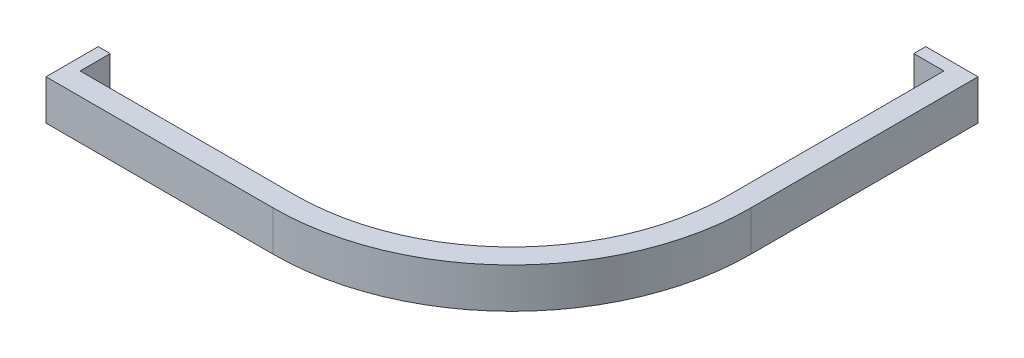
ISO-10303-21;
HEADER;
FILE_DESCRIPTION(('STEP AP214'),'2;1');
FILE_NAME('part.step','',(''),(''),'','','');
FILE_SCHEMA(('AUTOMOTIVE_DESIGN { 1 0 10303 214 1 1 1 1 }'));
ENDSEC;
DATA;
#1=APPLICATION_CONTEXT('core data for automotive mechanical design processes');
#2=APPLICATION_PROTOCOL_DEFINITION('international standard','automotive_design',2000,#1);
#3=PRODUCT_CONTEXT('',#1,'mechanical');
#4=PRODUCT('Part','Part','',(#3));
#5=PRODUCT_RELATED_PRODUCT_CATEGORY('part','',(#4));
#6=PRODUCT_DEFINITION_FORMATION('','',#4);
#7=PRODUCT_DEFINITION_CONTEXT('part definition',#1,'design');
#8=PRODUCT_DEFINITION('design','',#6,#7);
#9=PRODUCT_DEFINITION_SHAPE('','',#8);
#10=(LENGTH_UNIT() NAMED_UNIT(*) SI_UNIT(.MILLI.,.METRE.));
#11=(NAMED_UNIT(*) PLANE_ANGLE_UNIT() SI_UNIT($,.RADIAN.));
#12=(NAMED_UNIT(*) SI_UNIT($,.STERADIAN.) SOLID_ANGLE_UNIT());
#13=UNCERTAINTY_MEASURE_WITH_UNIT(LENGTH_MEASURE(1.E-05),#10,'distance_accuracy_value','');
#14=(GEOMETRIC_REPRESENTATION_CONTEXT(3) GLOBAL_UNCERTAINTY_ASSIGNED_CONTEXT((#13)) GLOBAL_UNIT_ASSIGNED_CONTEXT((#10,
#11,#12)) REPRESENTATION_CONTEXT('',''));
#15=CARTESIAN_POINT('',(0.,0.,0.));
#16=DIRECTION('',(0.,0.,1.));
#17=DIRECTION('',(1.,0.,0.));
#18=AXIS2_PLACEMENT_3D('',#15,#16,#17);
#19=CARTESIAN_POINT('',(0.,10.,103.07));
#20=DIRECTION('',(1.,0.,0.));
#21=DIRECTION('',(0.,0.,-1.));
#22=AXIS2_PLACEMENT_3D('',#19,#20,#21);
#23=PLANE('',#22);
#24=DIRECTION('',(0.,0.,1.));
#25=VECTOR('',#24,1.);
#26=CARTESIAN_POINT('',(0.,0.,103.07));
#27=LINE('',#26,#25);
#28=CARTESIAN_POINT('',(0.,0.,103.07));
#29=VERTEX_POINT('',#28);
#30=CARTESIAN_POINT('',(0.,0.,116.07));
#31=VERTEX_POINT('',#30);
#32=EDGE_CURVE('E153',#29,#31,#27,.T.);
#33=ORIENTED_EDGE('',*,*,#32,.T.);
#34=DIRECTION('',(0.,-1.,0.));
#35=VECTOR('',#34,1.);
#36=CARTESIAN_POINT('',(0.,10.,116.07));
#37=LINE('',#36,#35);
#38=CARTESIAN_POINT('',(0.,10.,116.07));
#39=VERTEX_POINT('',#38);
#40=EDGE_CURVE('E11',#39,#31,#37,.T.);
#41=ORIENTED_EDGE('',*,*,#40,.F.);
#42=DIRECTION('',(0.,0.,1.));
#43=VECTOR('',#42,1.);
#44=CARTESIAN_POINT('',(0.,10.,103.07));
#45=LINE('',#44,#43);
#46=CARTESIAN_POINT('',(0.,10.,103.07));
#47=VERTEX_POINT('',#46);
#48=EDGE_CURVE('E175',#47,#39,#45,.T.);
#49=ORIENTED_EDGE('',*,*,#48,.F.);
#50=DIRECTION('',(0.,-1.,0.));
#51=VECTOR('',#50,1.);
#52=CARTESIAN_POINT('',(0.,10.,103.07));
#53=LINE('',#52,#51);
#54=EDGE_CURVE('E149',#47,#29,#53,.T.);
#55=ORIENTED_EDGE('',*,*,#54,.T.);
#56=EDGE_LOOP('',(#33,#41,#49,#55));
#57=FACE_BOUND('',#56,.T.);
#58=ADVANCED_FACE('F33',(#57),#23,.F.);
#59=CARTESIAN_POINT('',(0.,10.,116.07));
#60=DIRECTION('',(0.,0.,-1.));
#61=DIRECTION('',(-1.,0.,0.));
#62=AXIS2_PLACEMENT_3D('',#59,#60,#61);
#63=PLANE('',#62);
#64=DIRECTION('',(1.,0.,0.));
#65=VECTOR('',#64,1.);
#66=CARTESIAN_POINT('',(0.,0.,116.07));
#67=LINE('',#66,#65);
#68=CARTESIAN_POINT('',(56.57,0.,116.07));
#69=VERTEX_POINT('',#68);
#70=EDGE_CURVE('E156',#31,#69,#67,.T.);
#71=ORIENTED_EDGE('',*,*,#70,.T.);
#72=DIRECTION('',(0.,-1.,0.));
#73=VECTOR('',#72,1.);
#74=CARTESIAN_POINT('',(56.57,10.,116.07));
#75=LINE('',#74,#73);
#76=CARTESIAN_POINT('',(56.57,10.,116.07));
#77=VERTEX_POINT('',#76);
#78=EDGE_CURVE('E41',#77,#69,#75,.T.);
#79=ORIENTED_EDGE('',*,*,#78,.F.);
#80=DIRECTION('',(1.,0.,0.));
#81=VECTOR('',#80,1.);
#82=CARTESIAN_POINT('',(0.,10.,116.07));
#83=LINE('',#82,#81);
#84=EDGE_CURVE('E104',#39,#77,#83,.T.);
#85=ORIENTED_EDGE('',*,*,#84,.F.);
#86=ORIENTED_EDGE('',*,*,#40,.T.);
#87=EDGE_LOOP('',(#71,#79,#85,#86));
#88=FACE_BOUND('',#87,.T.);
#89=ADVANCED_FACE('F253',(#88),#63,.F.);
#90=CARTESIAN_POINT('',(56.57,10.,56.57));
#91=DIRECTION('',(0.,-1.,0.));
#92=DIRECTION('',(0.,0.,-1.));
#93=AXIS2_PLACEMENT_3D('',#90,#91,#92);
#94=CYLINDRICAL_SURFACE('',#93,59.5);
#95=CARTESIAN_POINT('',(56.57,0.,56.57));
#96=DIRECTION('',(0.,1.,0.));
#97=DIRECTION('',(0.,0.,1.));
#98=AXIS2_PLACEMENT_3D('',#95,#96,#97);
#99=CIRCLE('',#98,59.5);
#100=CARTESIAN_POINT('',(116.07,0.,56.57));
#101=VERTEX_POINT('',#100);
#102=EDGE_CURVE('E158',#69,#101,#99,.T.);
#103=ORIENTED_EDGE('',*,*,#102,.T.);
#104=DIRECTION('',(0.,-1.,0.));
#105=VECTOR('',#104,1.);
#106=CARTESIAN_POINT('',(116.07,10.,56.57));
#107=LINE('',#106,#105);
#108=CARTESIAN_POINT('',(116.07,10.,56.57));
#109=VERTEX_POINT('',#108);
#110=EDGE_CURVE('E194',#109,#101,#107,.T.);
#111=ORIENTED_EDGE('',*,*,#110,.F.);
#112=CARTESIAN_POINT('',(56.57,10.,56.57));
#113=DIRECTION('',(0.,1.,0.));
#114=DIRECTION('',(0.,0.,1.));
#115=AXIS2_PLACEMENT_3D('',#112,#113,#114);
#116=CIRCLE('',#115,59.5);
#117=EDGE_CURVE('E202',#77,#109,#116,.T.);
#118=ORIENTED_EDGE('',*,*,#117,.F.);
#119=ORIENTED_EDGE('',*,*,#78,.T.);
#120=EDGE_LOOP('',(#103,#111,#118,#119));
#121=FACE_BOUND('',#120,.T.);
#122=ADVANCED_FACE('F200',(#121),#94,.T.);
#123=CARTESIAN_POINT('',(116.07,10.,56.57));
#124=DIRECTION('',(-1.,0.,0.));
#125=DIRECTION('',(0.,0.,1.));
#126=AXIS2_PLACEMENT_3D('',#123,#124,#125);
#127=PLANE('',#126);
#128=DIRECTION('',(0.,0.,-1.));
#129=VECTOR('',#128,1.);
#130=CARTESIAN_POINT('',(116.07,0.,56.57));
#131=LINE('',#130,#129);
#132=CARTESIAN_POINT('',(116.07,0.,0.));
#133=VERTEX_POINT('',#132);
#134=EDGE_CURVE('E160',#101,#133,#131,.T.);
#135=ORIENTED_EDGE('',*,*,#134,.T.);
#136=DIRECTION('',(0.,-1.,0.));
#137=VECTOR('',#136,1.);
#138=CARTESIAN_POINT('',(116.07,10.,0.));
#139=LINE('',#138,#137);
#140=CARTESIAN_POINT('',(116.07,10.,0.));
#141=VERTEX_POINT('',#140);
#142=EDGE_CURVE('E191',#141,#133,#139,.T.);
#143=ORIENTED_EDGE('',*,*,#142,.F.);
#144=DIRECTION('',(0.,0.,-1.));
#145=VECTOR('',#144,1.);
#146=CARTESIAN_POINT('',(116.07,10.,56.57));
#147=LINE('',#146,#145);
#148=EDGE_CURVE('E220',#109,#141,#147,.T.);
#149=ORIENTED_EDGE('',*,*,#148,.F.);
#150=ORIENTED_EDGE('',*,*,#110,.T.);
#151=EDGE_LOOP('',(#135,#143,#149,#150));
#152=FACE_BOUND('',#151,.T.);
#153=ADVANCED_FACE('F211',(#152),#127,.F.);
#154=CARTESIAN_POINT('',(116.07,10.,0.));
#155=DIRECTION('',(0.,0.,1.));
#156=DIRECTION('',(1.,0.,0.));
#157=AXIS2_PLACEMENT_3D('',#154,#155,#156);
#158=PLANE('',#157);
#159=DIRECTION('',(-1.,0.,0.));
#160=VECTOR('',#159,1.);
#161=CARTESIAN_POINT('',(116.07,0.,0.));
#162=LINE('',#161,#160);
#163=CARTESIAN_POINT('',(103.07,0.,0.));
#164=VERTEX_POINT('',#163);
#165=EDGE_CURVE('E162',#133,#164,#162,.T.);
#166=ORIENTED_EDGE('',*,*,#165,.T.);
#167=DIRECTION('',(0.,-1.,0.));
#168=VECTOR('',#167,1.);
#169=CARTESIAN_POINT('',(103.07,10.,0.));
#170=LINE('',#169,#168);
#171=CARTESIAN_POINT('',(103.07,10.,0.));
#172=VERTEX_POINT('',#171);
#173=EDGE_CURVE('E188',#172,#164,#170,.T.);
#174=ORIENTED_EDGE('',*,*,#173,.F.);
#175=DIRECTION('',(-1.,0.,0.));
#176=VECTOR('',#175,1.);
#177=CARTESIAN_POINT('',(116.07,10.,0.));
#178=LINE('',#177,#176);
#179=EDGE_CURVE('E217',#141,#172,#178,.T.);
#180=ORIENTED_EDGE('',*,*,#179,.F.);
#181=ORIENTED_EDGE('',*,*,#142,.T.);
#182=EDGE_LOOP('',(#166,#174,#180,#181));
#183=FACE_BOUND('',#182,.T.);
#184=ADVANCED_FACE('F215',(#183),#158,.F.);
#185=CARTESIAN_POINT('',(103.07,10.,2.99999999999999));
#186=DIRECTION('',(1.,0.,0.));
#187=DIRECTION('',(0.,0.,-1.));
#188=AXIS2_PLACEMENT_3D('',#185,#186,#187);
#189=PLANE('',#188);
#190=DIRECTION('',(0.,0.,1.));
#191=VECTOR('',#190,1.);
#192=CARTESIAN_POINT('',(103.07,0.,2.99999999999999));
#193=LINE('',#192,#191);
#194=CARTESIAN_POINT('',(103.07,0.,2.99999999999999));
#195=VERTEX_POINT('',#194);
#196=EDGE_CURVE('E164',#164,#195,#193,.T.);
#197=ORIENTED_EDGE('',*,*,#196,.T.);
#198=DIRECTION('',(0.,-1.,0.));
#199=VECTOR('',#198,1.);
#200=CARTESIAN_POINT('',(103.07,10.,2.99999999999999));
#201=LINE('',#200,#199);
#202=CARTESIAN_POINT('',(103.07,10.,2.99999999999999));
#203=VERTEX_POINT('',#202);
#204=EDGE_CURVE('E185',#203,#195,#201,.T.);
#205=ORIENTED_EDGE('',*,*,#204,.F.);
#206=DIRECTION('',(0.,0.,1.));
#207=VECTOR('',#206,1.);
#208=CARTESIAN_POINT('',(103.07,10.,2.99999999999999));
#209=LINE('',#208,#207);
#210=EDGE_CURVE('E219',#172,#203,#209,.T.);
#211=ORIENTED_EDGE('',*,*,#210,.F.);
#212=ORIENTED_EDGE('',*,*,#173,.T.);
#213=EDGE_LOOP('',(#197,#205,#211,#212));
#214=FACE_BOUND('',#213,.T.);
#215=ADVANCED_FACE('F266',(#214),#189,.F.);
#216=CARTESIAN_POINT('',(110.57,10.,2.99999999999999));
#217=DIRECTION('',(0.,0.,-1.));
#218=DIRECTION('',(-1.,0.,0.));
#219=AXIS2_PLACEMENT_3D('',#216,#217,#218);
#220=PLANE('',#219);
#221=DIRECTION('',(1.,0.,0.));
#222=VECTOR('',#221,1.);
#223=CARTESIAN_POINT('',(110.57,0.,2.99999999999999));
#224=LINE('',#223,#222);
#225=CARTESIAN_POINT('',(110.57,0.,2.99999999999999));
#226=VERTEX_POINT('',#225);
#227=EDGE_CURVE('E166',#195,#226,#224,.T.);
#228=ORIENTED_EDGE('',*,*,#227,.T.);
#229=DIRECTION('',(0.,-1.,0.));
#230=VECTOR('',#229,1.);
#231=CARTESIAN_POINT('',(110.57,10.,2.99999999999999));
#232=LINE('',#231,#230);
#233=CARTESIAN_POINT('',(110.57,10.,2.99999999999999));
#234=VERTEX_POINT('',#233);
#235=EDGE_CURVE('E182',#234,#226,#232,.T.);
#236=ORIENTED_EDGE('',*,*,#235,.F.);
#237=DIRECTION('',(1.,0.,0.));
#238=VECTOR('',#237,1.);
#239=CARTESIAN_POINT('',(110.57,10.,2.99999999999999));
#240=LINE('',#239,#238);
#241=EDGE_CURVE('E222',#203,#234,#240,.T.);
#242=ORIENTED_EDGE('',*,*,#241,.F.);
#243=ORIENTED_EDGE('',*,*,#204,.T.);
#244=EDGE_LOOP('',(#228,#236,#242,#243));
#245=FACE_BOUND('',#244,.T.);
#246=ADVANCED_FACE('F269',(#245),#220,.F.);
#247=CARTESIAN_POINT('',(110.57,10.,56.57));
#248=DIRECTION('',(1.,0.,0.));
#249=DIRECTION('',(0.,0.,-1.));
#250=AXIS2_PLACEMENT_3D('',#247,#248,#249);
#251=PLANE('',#250);
#252=DIRECTION('',(0.,0.,1.));
#253=VECTOR('',#252,1.);
#254=CARTESIAN_POINT('',(110.57,0.,56.57));
#255=LINE('',#254,#253);
#256=CARTESIAN_POINT('',(110.57,0.,56.57));
#257=VERTEX_POINT('',#256);
#258=EDGE_CURVE('E168',#226,#257,#255,.T.);
#259=ORIENTED_EDGE('',*,*,#258,.T.);
#260=DIRECTION('',(0.,-1.,0.));
#261=VECTOR('',#260,1.);
#262=CARTESIAN_POINT('',(110.57,10.,56.57));
#263=LINE('',#262,#261);
#264=CARTESIAN_POINT('',(110.57,10.,56.57));
#265=VERTEX_POINT('',#264);
#266=EDGE_CURVE('E179',#265,#257,#263,.T.);
#267=ORIENTED_EDGE('',*,*,#266,.F.);
#268=DIRECTION('',(0.,0.,1.));
#269=VECTOR('',#268,1.);
#270=CARTESIAN_POINT('',(110.57,10.,56.57));
#271=LINE('',#270,#269);
#272=EDGE_CURVE('E228',#234,#265,#271,.T.);
#273=ORIENTED_EDGE('',*,*,#272,.F.);
#274=ORIENTED_EDGE('',*,*,#235,.T.);
#275=EDGE_LOOP('',(#259,#267,#273,#274));
#276=FACE_BOUND('',#275,.T.);
#277=ADVANCED_FACE('F234',(#276),#251,.F.);
#278=CARTESIAN_POINT('',(56.57,10.,56.57));
#279=DIRECTION('',(0.,-1.,0.));
#280=DIRECTION('',(0.,0.,-1.));
#281=AXIS2_PLACEMENT_3D('',#278,#279,#280);
#282=CYLINDRICAL_SURFACE('',#281,54.);
#283=CARTESIAN_POINT('',(56.57,0.,56.57));
#284=DIRECTION('',(0.,-1.,0.));
#285=DIRECTION('',(0.,0.,-1.));
#286=AXIS2_PLACEMENT_3D('',#283,#284,#285);
#287=CIRCLE('',#286,54.);
#288=CARTESIAN_POINT('',(56.57,0.,110.57));
#289=VERTEX_POINT('',#288);
#290=EDGE_CURVE('E170',#257,#289,#287,.T.);
#291=ORIENTED_EDGE('',*,*,#290,.T.);
#292=DIRECTION('',(0.,-1.,0.));
#293=VECTOR('',#292,1.);
#294=CARTESIAN_POINT('',(56.57,10.,110.57));
#295=LINE('',#294,#293);
#296=CARTESIAN_POINT('',(56.57,10.,110.57));
#297=VERTEX_POINT('',#296);
#298=EDGE_CURVE('E144',#297,#289,#295,.T.);
#299=ORIENTED_EDGE('',*,*,#298,.F.);
#300=CARTESIAN_POINT('',(56.57,10.,56.57));
#301=DIRECTION('',(0.,-1.,0.));
#302=DIRECTION('',(0.,0.,-1.));
#303=AXIS2_PLACEMENT_3D('',#300,#301,#302);
#304=CIRCLE('',#303,54.);
#305=EDGE_CURVE('E135',#265,#297,#304,.T.);
#306=ORIENTED_EDGE('',*,*,#305,.F.);
#307=ORIENTED_EDGE('',*,*,#266,.T.);
#308=EDGE_LOOP('',(#291,#299,#306,#307));
#309=FACE_BOUND('',#308,.T.);
#310=ADVANCED_FACE('F238',(#309),#282,.F.);
#311=CARTESIAN_POINT('',(56.57,10.,110.57));
#312=DIRECTION('',(0.,0.,1.));
#313=DIRECTION('',(1.,0.,0.));
#314=AXIS2_PLACEMENT_3D('',#311,#312,#313);
#315=PLANE('',#314);
#316=DIRECTION('',(-1.,0.,0.));
#317=VECTOR('',#316,1.);
#318=CARTESIAN_POINT('',(56.57,0.,110.57));
#319=LINE('',#318,#317);
#320=CARTESIAN_POINT('',(3.,0.,110.57));
#321=VERTEX_POINT('',#320);
#322=EDGE_CURVE('E143',#289,#321,#319,.T.);
#323=ORIENTED_EDGE('',*,*,#322,.T.);
#324=DIRECTION('',(0.,-1.,0.));
#325=VECTOR('',#324,1.);
#326=CARTESIAN_POINT('',(3.,10.,110.57));
#327=LINE('',#326,#325);
#328=CARTESIAN_POINT('',(3.,10.,110.57));
#329=VERTEX_POINT('',#328);
#330=EDGE_CURVE('E140',#329,#321,#327,.T.);
#331=ORIENTED_EDGE('',*,*,#330,.F.);
#332=DIRECTION('',(-1.,0.,0.));
#333=VECTOR('',#332,1.);
#334=CARTESIAN_POINT('',(56.57,10.,110.57));
#335=LINE('',#334,#333);
#336=EDGE_CURVE('E129',#297,#329,#335,.T.);
#337=ORIENTED_EDGE('',*,*,#336,.F.);
#338=ORIENTED_EDGE('',*,*,#298,.T.);
#339=EDGE_LOOP('',(#323,#331,#337,#338));
#340=FACE_BOUND('',#339,.T.);
#341=ADVANCED_FACE('F141',(#340),#315,.F.);
#342=CARTESIAN_POINT('',(3.,10.,110.57));
#343=DIRECTION('',(-1.,0.,0.));
#344=DIRECTION('',(0.,0.,1.));
#345=AXIS2_PLACEMENT_3D('',#342,#343,#344);
#346=PLANE('',#345);
#347=DIRECTION('',(0.,0.,-1.));
#348=VECTOR('',#347,1.);
#349=CARTESIAN_POINT('',(3.,0.,110.57));
#350=LINE('',#349,#348);
#351=CARTESIAN_POINT('',(3.,0.,103.07));
#352=VERTEX_POINT('',#351);
#353=EDGE_CURVE('E90',#321,#352,#350,.T.);
#354=ORIENTED_EDGE('',*,*,#353,.T.);
#355=DIRECTION('',(0.,-1.,0.));
#356=VECTOR('',#355,1.);
#357=CARTESIAN_POINT('',(3.,10.,103.07));
#358=LINE('',#357,#356);
#359=CARTESIAN_POINT('',(3.,10.,103.07));
#360=VERTEX_POINT('',#359);
#361=EDGE_CURVE('E145',#360,#352,#358,.T.);
#362=ORIENTED_EDGE('',*,*,#361,.F.);
#363=DIRECTION('',(0.,0.,-1.));
#364=VECTOR('',#363,1.);
#365=CARTESIAN_POINT('',(3.,10.,110.57));
#366=LINE('',#365,#364);
#367=EDGE_CURVE('E133',#329,#360,#366,.T.);
#368=ORIENTED_EDGE('',*,*,#367,.F.);
#369=ORIENTED_EDGE('',*,*,#330,.T.);
#370=EDGE_LOOP('',(#354,#362,#368,#369));
#371=FACE_BOUND('',#370,.T.);
#372=ADVANCED_FACE('F147',(#371),#346,.F.);
#373=CARTESIAN_POINT('',(3.,10.,103.07));
#374=DIRECTION('',(0.,0.,1.));
#375=DIRECTION('',(1.,0.,0.));
#376=AXIS2_PLACEMENT_3D('',#373,#374,#375);
#377=PLANE('',#376);
#378=DIRECTION('',(-1.,0.,0.));
#379=VECTOR('',#378,1.);
#380=CARTESIAN_POINT('',(3.,0.,103.07));
#381=LINE('',#380,#379);
#382=EDGE_CURVE('E96',#352,#29,#381,.T.);
#383=ORIENTED_EDGE('',*,*,#382,.T.);
#384=ORIENTED_EDGE('',*,*,#54,.F.);
#385=DIRECTION('',(-1.,0.,0.));
#386=VECTOR('',#385,1.);
#387=CARTESIAN_POINT('',(3.,10.,103.07));
#388=LINE('',#387,#386);
#389=EDGE_CURVE('E49',#360,#47,#388,.T.);
#390=ORIENTED_EDGE('',*,*,#389,.F.);
#391=ORIENTED_EDGE('',*,*,#361,.T.);
#392=EDGE_LOOP('',(#383,#384,#390,#391));
#393=FACE_BOUND('',#392,.T.);
#394=ADVANCED_FACE('F242',(#393),#377,.F.);
#395=CARTESIAN_POINT('',(56.57,10.,56.57));
#396=DIRECTION('',(0.,1.,0.));
#397=DIRECTION('',(0.,0.,1.));
#398=AXIS2_PLACEMENT_3D('',#395,#396,#397);
#399=PLANE('',#398);
#400=ORIENTED_EDGE('',*,*,#48,.T.);
#401=ORIENTED_EDGE('',*,*,#84,.T.);
#402=ORIENTED_EDGE('',*,*,#117,.T.);
#403=ORIENTED_EDGE('',*,*,#148,.T.);
#404=ORIENTED_EDGE('',*,*,#179,.T.);
#405=ORIENTED_EDGE('',*,*,#210,.T.);
#406=ORIENTED_EDGE('',*,*,#241,.T.);
#407=ORIENTED_EDGE('',*,*,#272,.T.);
#408=ORIENTED_EDGE('',*,*,#305,.T.);
#409=ORIENTED_EDGE('',*,*,#336,.T.);
#410=ORIENTED_EDGE('',*,*,#367,.T.);
#411=ORIENTED_EDGE('',*,*,#389,.T.);
#412=EDGE_LOOP('',(#400,#401,#402,#403,#404,#405,#406,#407,#408,#409,#410,#411));
#413=FACE_BOUND('',#412,.T.);
#414=ADVANCED_FACE('F131',(#413),#399,.T.);
#415=CARTESIAN_POINT('',(56.57,0.,56.57));
#416=DIRECTION('',(0.,1.,0.));
#417=DIRECTION('',(0.,0.,1.));
#418=AXIS2_PLACEMENT_3D('',#415,#416,#417);
#419=PLANE('',#418);
#420=ORIENTED_EDGE('',*,*,#32,.F.);
#421=ORIENTED_EDGE('',*,*,#382,.F.);
#422=ORIENTED_EDGE('',*,*,#353,.F.);
#423=ORIENTED_EDGE('',*,*,#322,.F.);
#424=ORIENTED_EDGE('',*,*,#290,.F.);
#425=ORIENTED_EDGE('',*,*,#258,.F.);
#426=ORIENTED_EDGE('',*,*,#227,.F.);
#427=ORIENTED_EDGE('',*,*,#196,.F.);
#428=ORIENTED_EDGE('',*,*,#165,.F.);
#429=ORIENTED_EDGE('',*,*,#134,.F.);
#430=ORIENTED_EDGE('',*,*,#102,.F.);
#431=ORIENTED_EDGE('',*,*,#70,.F.);
#432=EDGE_LOOP('',(#420,#421,#422,#423,#424,#425,#426,#427,#428,#429,#430,#431));
#433=FACE_BOUND('',#432,.T.);
#434=ADVANCED_FACE('F206',(#433),#419,.F.);
#435=CLOSED_SHELL('',(#58,#89,#122,#153,#184,#215,#246,#277,#310,#341,#372,#394,#414,#434));
#436=MANIFOLD_SOLID_BREP('B2',#435);
#437=ADVANCED_BREP_SHAPE_REPRESENTATION('',(#18,#436),#14);
#438=SHAPE_DEFINITION_REPRESENTATION(#9,#437);
ENDSEC;
END-ISO-10303-21;
